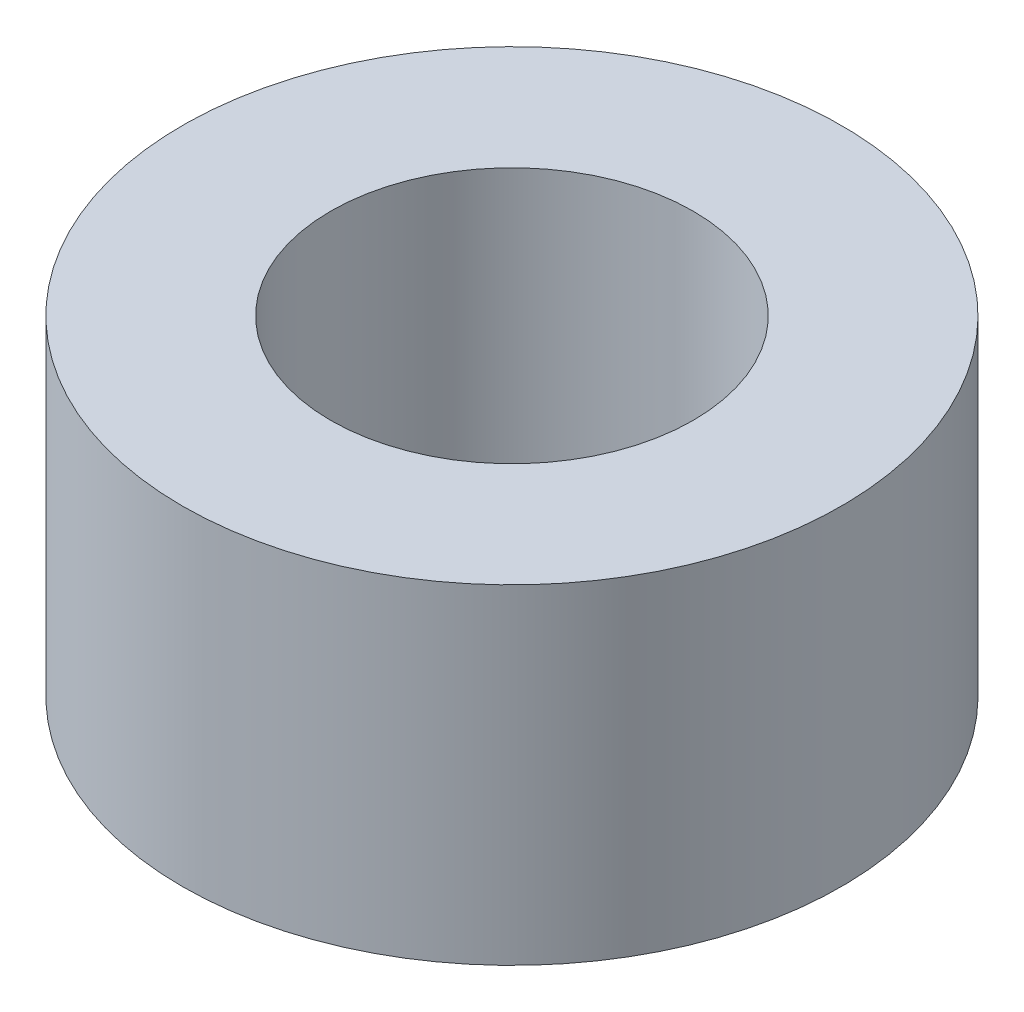
ISO-10303-21;
HEADER;
FILE_DESCRIPTION(('STEP AP214'),'2;1');
FILE_NAME('part.step','',(''),(''),'','','');
FILE_SCHEMA(('AUTOMOTIVE_DESIGN { 1 0 10303 214 1 1 1 1 }'));
ENDSEC;
DATA;
#1=APPLICATION_CONTEXT('core data for automotive mechanical design processes');
#2=APPLICATION_PROTOCOL_DEFINITION('international standard','automotive_design',2000,#1);
#3=PRODUCT_CONTEXT('',#1,'mechanical');
#4=PRODUCT('Part','Part','',(#3));
#5=PRODUCT_RELATED_PRODUCT_CATEGORY('part','',(#4));
#6=PRODUCT_DEFINITION_FORMATION('','',#4);
#7=PRODUCT_DEFINITION_CONTEXT('part definition',#1,'design');
#8=PRODUCT_DEFINITION('design','',#6,#7);
#9=PRODUCT_DEFINITION_SHAPE('','',#8);
#10=(LENGTH_UNIT() NAMED_UNIT(*) SI_UNIT(.MILLI.,.METRE.));
#11=(NAMED_UNIT(*) PLANE_ANGLE_UNIT() SI_UNIT($,.RADIAN.));
#12=(NAMED_UNIT(*) SI_UNIT($,.STERADIAN.) SOLID_ANGLE_UNIT());
#13=UNCERTAINTY_MEASURE_WITH_UNIT(LENGTH_MEASURE(1.E-05),#10,'distance_accuracy_value','');
#14=(GEOMETRIC_REPRESENTATION_CONTEXT(3) GLOBAL_UNCERTAINTY_ASSIGNED_CONTEXT((#13)) GLOBAL_UNIT_ASSIGNED_CONTEXT((#10,
#11,#12)) REPRESENTATION_CONTEXT('',''));
#15=CARTESIAN_POINT('',(0.,0.,0.));
#16=DIRECTION('',(0.,0.,1.));
#17=DIRECTION('',(1.,0.,0.));
#18=AXIS2_PLACEMENT_3D('',#15,#16,#17);
#19=CARTESIAN_POINT('',(0.,15.,0.));
#20=DIRECTION('',(0.,-1.,0.));
#21=DIRECTION('',(0.,0.,-1.));
#22=AXIS2_PLACEMENT_3D('',#19,#20,#21);
#23=CYLINDRICAL_SURFACE('',#22,15.);
#24=CARTESIAN_POINT('',(0.,15.,0.));
#25=DIRECTION('',(0.,1.,0.));
#26=DIRECTION('',(0.,0.,1.));
#27=AXIS2_PLACEMENT_3D('',#24,#25,#26);
#28=CIRCLE('',#27,15.);
#29=CARTESIAN_POINT('',(0.,15.,15.));
#30=VERTEX_POINT('',#29);
#31=EDGE_CURVE('E12',#30,#30,#28,.T.);
#32=ORIENTED_EDGE('',*,*,#31,.F.);
#33=EDGE_LOOP('',(#32));
#34=FACE_BOUND('',#33,.T.);
#35=CARTESIAN_POINT('',(0.,0.,0.));
#36=DIRECTION('',(0.,1.,0.));
#37=DIRECTION('',(0.,0.,1.));
#38=AXIS2_PLACEMENT_3D('',#35,#36,#37);
#39=CIRCLE('',#38,15.);
#40=CARTESIAN_POINT('',(0.,0.,15.));
#41=VERTEX_POINT('',#40);
#42=EDGE_CURVE('E49',#41,#41,#39,.T.);
#43=ORIENTED_EDGE('',*,*,#42,.T.);
#44=EDGE_LOOP('',(#43));
#45=FACE_BOUND('',#44,.T.);
#46=ADVANCED_FACE('F46',(#34,#45),#23,.T.);
#47=CARTESIAN_POINT('',(0.,15.,0.));
#48=DIRECTION('',(0.,1.,0.));
#49=DIRECTION('',(0.,0.,1.));
#50=AXIS2_PLACEMENT_3D('',#47,#48,#49);
#51=PLANE('',#50);
#52=CARTESIAN_POINT('',(0.,15.,0.));
#53=DIRECTION('',(0.,1.,0.));
#54=DIRECTION('',(0.,0.,1.));
#55=AXIS2_PLACEMENT_3D('',#52,#53,#54);
#56=CIRCLE('',#55,8.24999999999999);
#57=CARTESIAN_POINT('',(0.,15.,8.24999999999999));
#58=VERTEX_POINT('',#57);
#59=EDGE_CURVE('E60',#58,#58,#56,.T.);
#60=ORIENTED_EDGE('',*,*,#59,.F.);
#61=EDGE_LOOP('',(#60));
#62=FACE_BOUND('',#61,.T.);
#63=ORIENTED_EDGE('',*,*,#31,.T.);
#64=EDGE_LOOP('',(#63));
#65=FACE_BOUND('',#64,.T.);
#66=ADVANCED_FACE('F66',(#62,#65),#51,.T.);
#67=CARTESIAN_POINT('',(0.,0.,0.));
#68=DIRECTION('',(0.,1.,0.));
#69=DIRECTION('',(0.,0.,1.));
#70=AXIS2_PLACEMENT_3D('',#67,#68,#69);
#71=PLANE('',#70);
#72=CARTESIAN_POINT('',(0.,0.,0.));
#73=DIRECTION('',(0.,1.,0.));
#74=DIRECTION('',(0.,0.,1.));
#75=AXIS2_PLACEMENT_3D('',#72,#73,#74);
#76=CIRCLE('',#75,8.24999999999997);
#77=CARTESIAN_POINT('',(0.,0.,8.24999999999997));
#78=VERTEX_POINT('',#77);
#79=EDGE_CURVE('E56',#78,#78,#76,.T.);
#80=ORIENTED_EDGE('',*,*,#79,.T.);
#81=EDGE_LOOP('',(#80));
#82=FACE_BOUND('',#81,.T.);
#83=ORIENTED_EDGE('',*,*,#42,.F.);
#84=EDGE_LOOP('',(#83));
#85=FACE_BOUND('',#84,.T.);
#86=ADVANCED_FACE('F68',(#82,#85),#71,.F.);
#87=CARTESIAN_POINT('',(0.,15.,0.));
#88=DIRECTION('',(0.,1.,0.));
#89=DIRECTION('',(0.,0.,1.));
#90=AXIS2_PLACEMENT_3D('',#87,#88,#89);
#91=CYLINDRICAL_SURFACE('',#90,8.24999999999998);
#92=ORIENTED_EDGE('',*,*,#79,.F.);
#93=EDGE_LOOP('',(#92));
#94=FACE_BOUND('',#93,.T.);
#95=ORIENTED_EDGE('',*,*,#59,.T.);
#96=EDGE_LOOP('',(#95));
#97=FACE_BOUND('',#96,.T.);
#98=ADVANCED_FACE('F64',(#94,#97),#91,.F.);
#99=CLOSED_SHELL('',(#46,#66,#86,#98));
#100=MANIFOLD_SOLID_BREP('B2',#99);
#101=ADVANCED_BREP_SHAPE_REPRESENTATION('',(#18,#100),#14);
#102=SHAPE_DEFINITION_REPRESENTATION(#9,#101);
ENDSEC;
END-ISO-10303-21;
